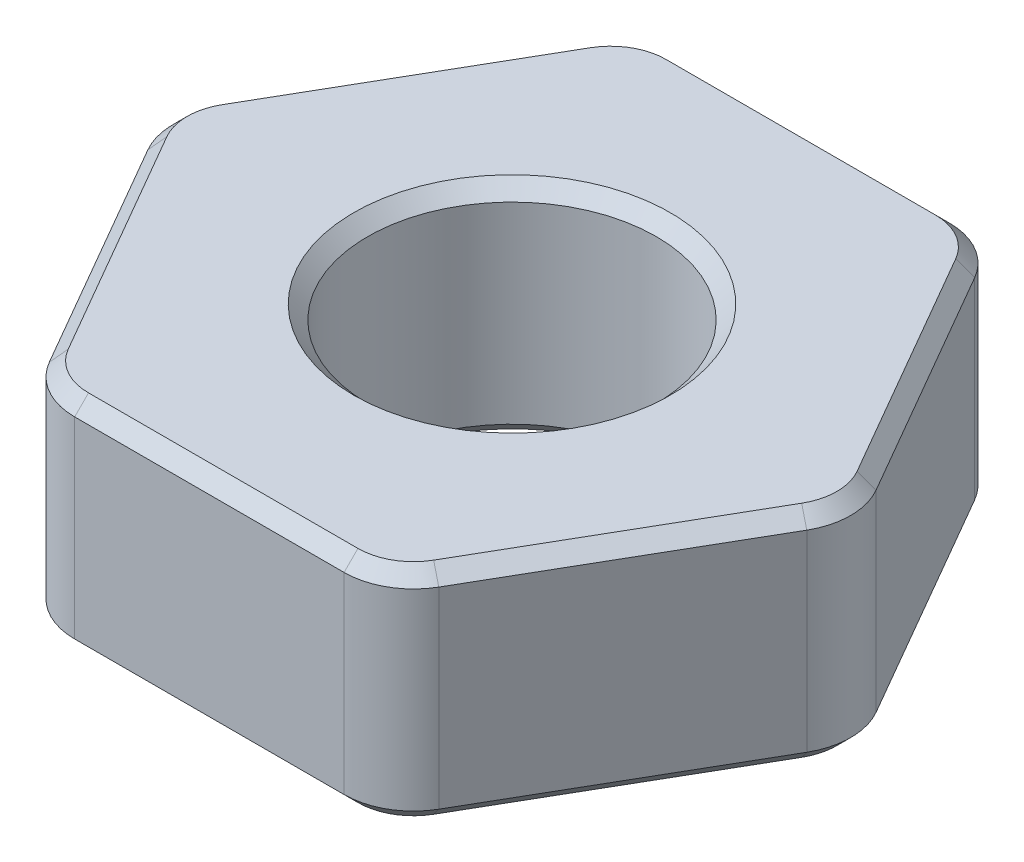
ISO-10303-21;
HEADER;
FILE_DESCRIPTION(('STEP AP214'),'2;1');
FILE_NAME('part.step','',(''),(''),'','','');
FILE_SCHEMA(('AUTOMOTIVE_DESIGN { 1 0 10303 214 1 1 1 1 }'));
ENDSEC;
DATA;
#1=APPLICATION_CONTEXT('core data for automotive mechanical design processes');
#2=APPLICATION_PROTOCOL_DEFINITION('international standard','automotive_design',2000,#1);
#3=PRODUCT_CONTEXT('',#1,'mechanical');
#4=PRODUCT('Part','Part','',(#3));
#5=PRODUCT_RELATED_PRODUCT_CATEGORY('part','',(#4));
#6=PRODUCT_DEFINITION_FORMATION('','',#4);
#7=PRODUCT_DEFINITION_CONTEXT('part definition',#1,'design');
#8=PRODUCT_DEFINITION('design','',#6,#7);
#9=PRODUCT_DEFINITION_SHAPE('','',#8);
#10=(LENGTH_UNIT() NAMED_UNIT(*) SI_UNIT(.MILLI.,.METRE.));
#11=(NAMED_UNIT(*) PLANE_ANGLE_UNIT() SI_UNIT($,.RADIAN.));
#12=(NAMED_UNIT(*) SI_UNIT($,.STERADIAN.) SOLID_ANGLE_UNIT());
#13=UNCERTAINTY_MEASURE_WITH_UNIT(LENGTH_MEASURE(1.E-05),#10,'distance_accuracy_value','');
#14=(GEOMETRIC_REPRESENTATION_CONTEXT(3) GLOBAL_UNCERTAINTY_ASSIGNED_CONTEXT((#13)) GLOBAL_UNIT_ASSIGNED_CONTEXT((#10,
#11,#12)) REPRESENTATION_CONTEXT('',''));
#15=CARTESIAN_POINT('',(0.,0.,0.));
#16=DIRECTION('',(0.,0.,1.));
#17=DIRECTION('',(1.,0.,0.));
#18=AXIS2_PLACEMENT_3D('',#15,#16,#17);
#19=CARTESIAN_POINT('',(0.,1.5875,0.));
#20=DIRECTION('',(0.,1.,0.));
#21=DIRECTION('',(0.,0.,1.));
#22=AXIS2_PLACEMENT_3D('',#19,#20,#21);
#23=PLANE('',#22);
#24=CARTESIAN_POINT('',(0.,1.5875,0.));
#25=DIRECTION('',(0.,1.,0.));
#26=DIRECTION('',(0.,0.,1.));
#27=AXIS2_PLACEMENT_3D('',#24,#25,#26);
#28=CIRCLE('',#27,2.2828);
#29=CARTESIAN_POINT('',(0.,1.5875,2.2828));
#30=VERTEX_POINT('',#29);
#31=EDGE_CURVE('E11',#30,#30,#28,.F.);
#32=ORIENTED_EDGE('',*,*,#31,.T.);
#33=EDGE_LOOP('',(#32));
#34=FACE_BOUND('',#33,.T.);
#35=DIRECTION('',(1.,0.,0.));
#36=VECTOR('',#35,1.);
#37=CARTESIAN_POINT('',(1.94314449974133,1.5875,4.165625));
#38=LINE('',#37,#36);
#39=CARTESIAN_POINT('',(-1.94314449974133,1.5875,4.165625));
#40=VERTEX_POINT('',#39);
#41=CARTESIAN_POINT('',(1.94314449974133,1.5875,4.165625));
#42=VERTEX_POINT('',#41);
#43=EDGE_CURVE('E51',#40,#42,#38,.T.);
#44=ORIENTED_EDGE('',*,*,#43,.T.);
#45=CARTESIAN_POINT('',(1.94314449974133,1.5875,3.365625));
#46=DIRECTION('',(0.,1.,0.));
#47=DIRECTION('',(0.,0.,1.));
#48=AXIS2_PLACEMENT_3D('',#45,#46,#47);
#49=CIRCLE('',#48,0.799999999999999);
#50=CARTESIAN_POINT('',(2.63596482276888,1.5875,3.765625));
#51=VERTEX_POINT('',#50);
#52=EDGE_CURVE('E43',#42,#51,#49,.T.);
#53=ORIENTED_EDGE('',*,*,#52,.T.);
#54=DIRECTION('',(0.5,0.,-0.866025403784439));
#55=VECTOR('',#54,1.);
#56=CARTESIAN_POINT('',(4.57910932251022,1.5875,0.399999999999998));
#57=LINE('',#56,#55);
#58=CARTESIAN_POINT('',(4.57910932251022,1.5875,0.399999999999998));
#59=VERTEX_POINT('',#58);
#60=EDGE_CURVE('E285',#51,#59,#57,.T.);
#61=ORIENTED_EDGE('',*,*,#60,.T.);
#62=CARTESIAN_POINT('',(3.88628899948267,1.5875,0.));
#63=DIRECTION('',(0.,1.,0.));
#64=DIRECTION('',(0.,0.,1.));
#65=AXIS2_PLACEMENT_3D('',#62,#63,#64);
#66=CIRCLE('',#65,0.8);
#67=CARTESIAN_POINT('',(4.57910932251022,1.5875,-0.400000000000002));
#68=VERTEX_POINT('',#67);
#69=EDGE_CURVE('E287',#59,#68,#66,.T.);
#70=ORIENTED_EDGE('',*,*,#69,.T.);
#71=DIRECTION('',(-0.5,0.,-0.866025403784439));
#72=VECTOR('',#71,1.);
#73=CARTESIAN_POINT('',(2.63596482276888,1.5875,-3.765625));
#74=LINE('',#73,#72);
#75=CARTESIAN_POINT('',(2.63596482276888,1.5875,-3.765625));
#76=VERTEX_POINT('',#75);
#77=EDGE_CURVE('E289',#68,#76,#74,.T.);
#78=ORIENTED_EDGE('',*,*,#77,.T.);
#79=CARTESIAN_POINT('',(1.94314449974133,1.5875,-3.365625));
#80=DIRECTION('',(0.,1.,0.));
#81=DIRECTION('',(0.,0.,1.));
#82=AXIS2_PLACEMENT_3D('',#79,#80,#81);
#83=CIRCLE('',#82,0.8);
#84=CARTESIAN_POINT('',(1.94314449974133,1.5875,-4.165625));
#85=VERTEX_POINT('',#84);
#86=EDGE_CURVE('E291',#76,#85,#83,.T.);
#87=ORIENTED_EDGE('',*,*,#86,.T.);
#88=DIRECTION('',(-1.,0.,0.));
#89=VECTOR('',#88,1.);
#90=CARTESIAN_POINT('',(-1.94314449974133,1.5875,-4.165625));
#91=LINE('',#90,#89);
#92=CARTESIAN_POINT('',(-1.94314449974133,1.5875,-4.165625));
#93=VERTEX_POINT('',#92);
#94=EDGE_CURVE('E293',#85,#93,#91,.T.);
#95=ORIENTED_EDGE('',*,*,#94,.T.);
#96=CARTESIAN_POINT('',(-1.94314449974133,1.5875,-3.365625));
#97=DIRECTION('',(0.,1.,0.));
#98=DIRECTION('',(0.,0.,1.));
#99=AXIS2_PLACEMENT_3D('',#96,#97,#98);
#100=CIRCLE('',#99,0.799999999999999);
#101=CARTESIAN_POINT('',(-2.63596482276889,1.5875,-3.765625));
#102=VERTEX_POINT('',#101);
#103=EDGE_CURVE('E295',#93,#102,#100,.T.);
#104=ORIENTED_EDGE('',*,*,#103,.T.);
#105=DIRECTION('',(-0.5,0.,0.866025403784439));
#106=VECTOR('',#105,1.);
#107=CARTESIAN_POINT('',(-4.57910932251022,1.5875,-0.400000000000002));
#108=LINE('',#107,#106);
#109=CARTESIAN_POINT('',(-4.57910932251022,1.5875,-0.400000000000002));
#110=VERTEX_POINT('',#109);
#111=EDGE_CURVE('E297',#102,#110,#108,.T.);
#112=ORIENTED_EDGE('',*,*,#111,.T.);
#113=CARTESIAN_POINT('',(-3.88628899948267,1.5875,0.));
#114=DIRECTION('',(0.,1.,0.));
#115=DIRECTION('',(0.,0.,1.));
#116=AXIS2_PLACEMENT_3D('',#113,#114,#115);
#117=CIRCLE('',#116,0.8);
#118=CARTESIAN_POINT('',(-4.57910932251022,1.5875,0.399999999999998));
#119=VERTEX_POINT('',#118);
#120=EDGE_CURVE('E299',#110,#119,#117,.T.);
#121=ORIENTED_EDGE('',*,*,#120,.T.);
#122=DIRECTION('',(0.5,0.,0.866025403784439));
#123=VECTOR('',#122,1.);
#124=CARTESIAN_POINT('',(-2.63596482276888,1.5875,3.765625));
#125=LINE('',#124,#123);
#126=CARTESIAN_POINT('',(-2.63596482276888,1.5875,3.765625));
#127=VERTEX_POINT('',#126);
#128=EDGE_CURVE('E301',#119,#127,#125,.T.);
#129=ORIENTED_EDGE('',*,*,#128,.T.);
#130=CARTESIAN_POINT('',(-1.94314449974133,1.5875,3.365625));
#131=DIRECTION('',(0.,1.,0.));
#132=DIRECTION('',(0.,0.,1.));
#133=AXIS2_PLACEMENT_3D('',#130,#131,#132);
#134=CIRCLE('',#133,0.799999999999999);
#135=EDGE_CURVE('E56',#127,#40,#134,.T.);
#136=ORIENTED_EDGE('',*,*,#135,.T.);
#137=EDGE_LOOP('',(#44,#53,#61,#70,#78,#87,#95,#104,#112,#121,#129,#136));
#138=FACE_BOUND('',#137,.T.);
#139=ADVANCED_FACE('F34',(#34,#138),#23,.T.);
#140=CARTESIAN_POINT('',(0.,-1.5875,0.));
#141=DIRECTION('',(0.,1.,0.));
#142=DIRECTION('',(0.,0.,1.));
#143=AXIS2_PLACEMENT_3D('',#140,#141,#142);
#144=PLANE('',#143);
#145=CARTESIAN_POINT('',(0.,-1.5875,0.));
#146=DIRECTION('',(0.,1.,0.));
#147=DIRECTION('',(0.,0.,1.));
#148=AXIS2_PLACEMENT_3D('',#145,#146,#147);
#149=CIRCLE('',#148,2.2828);
#150=CARTESIAN_POINT('',(0.,-1.5875,2.2828));
#151=VERTEX_POINT('',#150);
#152=EDGE_CURVE('E223',#151,#151,#149,.T.);
#153=ORIENTED_EDGE('',*,*,#152,.T.);
#154=EDGE_LOOP('',(#153));
#155=FACE_BOUND('',#154,.T.);
#156=DIRECTION('',(1.,0.,0.));
#157=VECTOR('',#156,1.);
#158=CARTESIAN_POINT('',(0.,-1.5875,-4.165625));
#159=LINE('',#158,#157);
#160=CARTESIAN_POINT('',(-1.94314449974133,-1.5875,-4.165625));
#161=VERTEX_POINT('',#160);
#162=CARTESIAN_POINT('',(1.94314449974133,-1.5875,-4.165625));
#163=VERTEX_POINT('',#162);
#164=EDGE_CURVE('E221',#161,#163,#159,.T.);
#165=ORIENTED_EDGE('',*,*,#164,.T.);
#166=CARTESIAN_POINT('',(1.94314449974133,-1.5875,-3.365625));
#167=DIRECTION('',(0.,1.,0.));
#168=DIRECTION('',(0.,0.,1.));
#169=AXIS2_PLACEMENT_3D('',#166,#167,#168);
#170=CIRCLE('',#169,0.800000000000001);
#171=CARTESIAN_POINT('',(2.63596482276889,-1.5875,-3.765625));
#172=VERTEX_POINT('',#171);
#173=EDGE_CURVE('E202',#163,#172,#170,.F.);
#174=ORIENTED_EDGE('',*,*,#173,.T.);
#175=DIRECTION('',(0.5,0.,0.866025403784439));
#176=VECTOR('',#175,1.);
#177=CARTESIAN_POINT('',(3.60753707263955,-1.5875,-2.0828125));
#178=LINE('',#177,#176);
#179=CARTESIAN_POINT('',(4.57910932251022,-1.5875,-0.400000000000002));
#180=VERTEX_POINT('',#179);
#181=EDGE_CURVE('E210',#172,#180,#178,.T.);
#182=ORIENTED_EDGE('',*,*,#181,.T.);
#183=CARTESIAN_POINT('',(3.88628899948267,-1.5875,0.));
#184=DIRECTION('',(0.,1.,0.));
#185=DIRECTION('',(0.,0.,1.));
#186=AXIS2_PLACEMENT_3D('',#183,#184,#185);
#187=CIRCLE('',#186,0.800000000000001);
#188=CARTESIAN_POINT('',(4.57910932251022,-1.5875,0.399999999999998));
#189=VERTEX_POINT('',#188);
#190=EDGE_CURVE('E216',#180,#189,#187,.F.);
#191=ORIENTED_EDGE('',*,*,#190,.T.);
#192=DIRECTION('',(-0.5,0.,0.866025403784439));
#193=VECTOR('',#192,1.);
#194=CARTESIAN_POINT('',(3.60753707263955,-1.5875,2.0828125));
#195=LINE('',#194,#193);
#196=CARTESIAN_POINT('',(2.63596482276889,-1.5875,3.765625));
#197=VERTEX_POINT('',#196);
#198=EDGE_CURVE('E399',#189,#197,#195,.T.);
#199=ORIENTED_EDGE('',*,*,#198,.T.);
#200=CARTESIAN_POINT('',(1.94314449974133,-1.5875,3.365625));
#201=DIRECTION('',(0.,1.,0.));
#202=DIRECTION('',(0.,0.,1.));
#203=AXIS2_PLACEMENT_3D('',#200,#201,#202);
#204=CIRCLE('',#203,0.800000000000001);
#205=CARTESIAN_POINT('',(1.94314449974133,-1.5875,4.165625));
#206=VERTEX_POINT('',#205);
#207=EDGE_CURVE('E401',#197,#206,#204,.F.);
#208=ORIENTED_EDGE('',*,*,#207,.T.);
#209=DIRECTION('',(-1.,0.,0.));
#210=VECTOR('',#209,1.);
#211=CARTESIAN_POINT('',(0.,-1.5875,4.165625));
#212=LINE('',#211,#210);
#213=CARTESIAN_POINT('',(-1.94314449974133,-1.5875,4.165625));
#214=VERTEX_POINT('',#213);
#215=EDGE_CURVE('E403',#206,#214,#212,.T.);
#216=ORIENTED_EDGE('',*,*,#215,.T.);
#217=CARTESIAN_POINT('',(-1.94314449974133,-1.5875,3.365625));
#218=DIRECTION('',(0.,1.,0.));
#219=DIRECTION('',(0.,0.,1.));
#220=AXIS2_PLACEMENT_3D('',#217,#218,#219);
#221=CIRCLE('',#220,0.800000000000001);
#222=CARTESIAN_POINT('',(-2.63596482276888,-1.5875,3.765625));
#223=VERTEX_POINT('',#222);
#224=EDGE_CURVE('E405',#214,#223,#221,.F.);
#225=ORIENTED_EDGE('',*,*,#224,.T.);
#226=DIRECTION('',(-0.5,0.,-0.866025403784439));
#227=VECTOR('',#226,1.);
#228=CARTESIAN_POINT('',(-3.60753707263955,-1.5875,2.0828125));
#229=LINE('',#228,#227);
#230=CARTESIAN_POINT('',(-4.57910932251022,-1.5875,0.399999999999999));
#231=VERTEX_POINT('',#230);
#232=EDGE_CURVE('E407',#223,#231,#229,.T.);
#233=ORIENTED_EDGE('',*,*,#232,.T.);
#234=CARTESIAN_POINT('',(-3.88628899948267,-1.5875,0.));
#235=DIRECTION('',(0.,1.,0.));
#236=DIRECTION('',(0.,0.,1.));
#237=AXIS2_PLACEMENT_3D('',#234,#235,#236);
#238=CIRCLE('',#237,0.800000000000001);
#239=CARTESIAN_POINT('',(-4.57910932251022,-1.5875,-0.400000000000002));
#240=VERTEX_POINT('',#239);
#241=EDGE_CURVE('E409',#231,#240,#238,.F.);
#242=ORIENTED_EDGE('',*,*,#241,.T.);
#243=DIRECTION('',(0.5,0.,-0.866025403784439));
#244=VECTOR('',#243,1.);
#245=CARTESIAN_POINT('',(-3.60753707263955,-1.5875,-2.0828125));
#246=LINE('',#245,#244);
#247=CARTESIAN_POINT('',(-2.63596482276889,-1.5875,-3.765625));
#248=VERTEX_POINT('',#247);
#249=EDGE_CURVE('E411',#240,#248,#246,.T.);
#250=ORIENTED_EDGE('',*,*,#249,.T.);
#251=CARTESIAN_POINT('',(-1.94314449974133,-1.5875,-3.365625));
#252=DIRECTION('',(0.,1.,0.));
#253=DIRECTION('',(0.,0.,1.));
#254=AXIS2_PLACEMENT_3D('',#251,#252,#253);
#255=CIRCLE('',#254,0.800000000000001);
#256=EDGE_CURVE('E228',#248,#161,#255,.F.);
#257=ORIENTED_EDGE('',*,*,#256,.T.);
#258=EDGE_LOOP('',(#165,#174,#182,#191,#199,#208,#216,#225,#233,#242,#250,#257));
#259=FACE_BOUND('',#258,.T.);
#260=ADVANCED_FACE('F219',(#155,#259),#144,.F.);
#261=CARTESIAN_POINT('',(5.04098953786192,1.5875,0.));
#262=DIRECTION('',(-0.866025403784438,0.,0.5));
#263=DIRECTION('',(0.5,0.,0.866025403784439));
#264=AXIS2_PLACEMENT_3D('',#261,#262,#263);
#265=PLANE('',#264);
#266=DIRECTION('',(0.,-1.,0.));
#267=VECTOR('',#266,1.);
#268=CARTESIAN_POINT('',(4.75231440326711,1.5875,-0.500000000000002));
#269=LINE('',#268,#267);
#270=CARTESIAN_POINT('',(4.75231440326711,1.3875,-0.500000000000002));
#271=VERTEX_POINT('',#270);
#272=CARTESIAN_POINT('',(4.75231440326711,-1.3875,-0.500000000000002));
#273=VERTEX_POINT('',#272);
#274=EDGE_CURVE('E428',#271,#273,#269,.T.);
#275=ORIENTED_EDGE('',*,*,#274,.T.);
#276=DIRECTION('',(-0.5,0.,-0.866025403784439));
#277=VECTOR('',#276,1.);
#278=CARTESIAN_POINT('',(5.04098953786192,-1.3875,0.));
#279=LINE('',#278,#277);
#280=CARTESIAN_POINT('',(2.80916990352577,-1.3875,-3.865625));
#281=VERTEX_POINT('',#280);
#282=EDGE_CURVE('E283',#273,#281,#279,.T.);
#283=ORIENTED_EDGE('',*,*,#282,.T.);
#284=DIRECTION('',(0.,-1.,0.));
#285=VECTOR('',#284,1.);
#286=CARTESIAN_POINT('',(2.80916990352577,1.5875,-3.865625));
#287=LINE('',#286,#285);
#288=CARTESIAN_POINT('',(2.80916990352577,1.3875,-3.865625));
#289=VERTEX_POINT('',#288);
#290=EDGE_CURVE('E335',#281,#289,#287,.F.);
#291=ORIENTED_EDGE('',*,*,#290,.T.);
#292=DIRECTION('',(0.5,0.,0.866025403784439));
#293=VECTOR('',#292,1.);
#294=CARTESIAN_POINT('',(4.75231440326711,1.3875,-0.500000000000001));
#295=LINE('',#294,#293);
#296=EDGE_CURVE('E281',#289,#271,#295,.T.);
#297=ORIENTED_EDGE('',*,*,#296,.T.);
#298=EDGE_LOOP('',(#275,#283,#291,#297));
#299=FACE_BOUND('',#298,.T.);
#300=ADVANCED_FACE('F486',(#299),#265,.F.);
#301=CARTESIAN_POINT('',(2.52049476893096,1.5875,-4.365625));
#302=DIRECTION('',(0.,0.,1.));
#303=DIRECTION('',(1.,0.,0.));
#304=AXIS2_PLACEMENT_3D('',#301,#302,#303);
#305=PLANE('',#304);
#306=DIRECTION('',(0.,-1.,0.));
#307=VECTOR('',#306,1.);
#308=CARTESIAN_POINT('',(1.94314449974133,1.5875,-4.365625));
#309=LINE('',#308,#307);
#310=CARTESIAN_POINT('',(1.94314449974133,1.3875,-4.365625));
#311=VERTEX_POINT('',#310);
#312=CARTESIAN_POINT('',(1.94314449974133,-1.3875,-4.365625));
#313=VERTEX_POINT('',#312);
#314=EDGE_CURVE('E392',#311,#313,#309,.T.);
#315=ORIENTED_EDGE('',*,*,#314,.T.);
#316=DIRECTION('',(-1.,0.,0.));
#317=VECTOR('',#316,1.);
#318=CARTESIAN_POINT('',(2.52049476893096,-1.3875,-4.365625));
#319=LINE('',#318,#317);
#320=CARTESIAN_POINT('',(-1.94314449974133,-1.3875,-4.365625));
#321=VERTEX_POINT('',#320);
#322=EDGE_CURVE('E242',#313,#321,#319,.T.);
#323=ORIENTED_EDGE('',*,*,#322,.T.);
#324=DIRECTION('',(0.,-1.,0.));
#325=VECTOR('',#324,1.);
#326=CARTESIAN_POINT('',(-1.94314449974133,1.5875,-4.365625));
#327=LINE('',#326,#325);
#328=CARTESIAN_POINT('',(-1.94314449974133,1.3875,-4.365625));
#329=VERTEX_POINT('',#328);
#330=EDGE_CURVE('E217',#321,#329,#327,.F.);
#331=ORIENTED_EDGE('',*,*,#330,.T.);
#332=DIRECTION('',(1.,0.,0.));
#333=VECTOR('',#332,1.);
#334=CARTESIAN_POINT('',(1.94314449974133,1.3875,-4.365625));
#335=LINE('',#334,#333);
#336=EDGE_CURVE('E240',#329,#311,#335,.T.);
#337=ORIENTED_EDGE('',*,*,#336,.T.);
#338=EDGE_LOOP('',(#315,#323,#331,#337));
#339=FACE_BOUND('',#338,.T.);
#340=ADVANCED_FACE('F389',(#339),#305,.F.);
#341=CARTESIAN_POINT('',(-2.52049476893096,1.5875,-4.365625));
#342=DIRECTION('',(0.866025403784439,0.,0.5));
#343=DIRECTION('',(0.5,0.,-0.866025403784439));
#344=AXIS2_PLACEMENT_3D('',#341,#342,#343);
#345=PLANE('',#344);
#346=DIRECTION('',(0.,-1.,0.));
#347=VECTOR('',#346,1.);
#348=CARTESIAN_POINT('',(-2.80916990352577,1.5875,-3.865625));
#349=LINE('',#348,#347);
#350=CARTESIAN_POINT('',(-2.80916990352577,1.3875,-3.865625));
#351=VERTEX_POINT('',#350);
#352=CARTESIAN_POINT('',(-2.80916990352577,-1.3875,-3.865625));
#353=VERTEX_POINT('',#352);
#354=EDGE_CURVE('E386',#351,#353,#349,.T.);
#355=ORIENTED_EDGE('',*,*,#354,.T.);
#356=DIRECTION('',(-0.5,0.,0.866025403784439));
#357=VECTOR('',#356,1.);
#358=CARTESIAN_POINT('',(-2.52049476893096,-1.3875,-4.365625));
#359=LINE('',#358,#357);
#360=CARTESIAN_POINT('',(-4.75231440326711,-1.3875,-0.500000000000002));
#361=VERTEX_POINT('',#360);
#362=EDGE_CURVE('E250',#353,#361,#359,.T.);
#363=ORIENTED_EDGE('',*,*,#362,.T.);
#364=DIRECTION('',(0.,-1.,0.));
#365=VECTOR('',#364,1.);
#366=CARTESIAN_POINT('',(-4.75231440326711,1.5875,-0.500000000000002));
#367=LINE('',#366,#365);
#368=CARTESIAN_POINT('',(-4.75231440326711,1.3875,-0.500000000000002));
#369=VERTEX_POINT('',#368);
#370=EDGE_CURVE('E394',#361,#369,#367,.F.);
#371=ORIENTED_EDGE('',*,*,#370,.T.);
#372=DIRECTION('',(0.5,0.,-0.866025403784439));
#373=VECTOR('',#372,1.);
#374=CARTESIAN_POINT('',(-2.80916990352577,1.3875,-3.865625));
#375=LINE('',#374,#373);
#376=EDGE_CURVE('E248',#369,#351,#375,.T.);
#377=ORIENTED_EDGE('',*,*,#376,.T.);
#378=EDGE_LOOP('',(#355,#363,#371,#377));
#379=FACE_BOUND('',#378,.T.);
#380=ADVANCED_FACE('F454',(#379),#345,.F.);
#381=CARTESIAN_POINT('',(-5.04098953786192,1.5875,0.));
#382=DIRECTION('',(0.866025403784439,0.,-0.5));
#383=DIRECTION('',(-0.5,0.,-0.866025403784439));
#384=AXIS2_PLACEMENT_3D('',#381,#382,#383);
#385=PLANE('',#384);
#386=DIRECTION('',(0.,-1.,0.));
#387=VECTOR('',#386,1.);
#388=CARTESIAN_POINT('',(-4.75231440326711,1.5875,0.499999999999998));
#389=LINE('',#388,#387);
#390=CARTESIAN_POINT('',(-4.75231440326711,1.3875,0.499999999999998));
#391=VERTEX_POINT('',#390);
#392=CARTESIAN_POINT('',(-4.75231440326711,-1.3875,0.499999999999998));
#393=VERTEX_POINT('',#392);
#394=EDGE_CURVE('E448',#391,#393,#389,.T.);
#395=ORIENTED_EDGE('',*,*,#394,.T.);
#396=DIRECTION('',(0.5,0.,0.866025403784439));
#397=VECTOR('',#396,1.);
#398=CARTESIAN_POINT('',(-5.04098953786192,-1.3875,0.));
#399=LINE('',#398,#397);
#400=CARTESIAN_POINT('',(-2.80916990352577,-1.3875,3.865625));
#401=VERTEX_POINT('',#400);
#402=EDGE_CURVE('E258',#393,#401,#399,.T.);
#403=ORIENTED_EDGE('',*,*,#402,.T.);
#404=DIRECTION('',(0.,-1.,0.));
#405=VECTOR('',#404,1.);
#406=CARTESIAN_POINT('',(-2.80916990352577,1.5875,3.865625));
#407=LINE('',#406,#405);
#408=CARTESIAN_POINT('',(-2.80916990352577,1.3875,3.865625));
#409=VERTEX_POINT('',#408);
#410=EDGE_CURVE('E445',#401,#409,#407,.F.);
#411=ORIENTED_EDGE('',*,*,#410,.T.);
#412=DIRECTION('',(-0.5,0.,-0.866025403784439));
#413=VECTOR('',#412,1.);
#414=CARTESIAN_POINT('',(-4.75231440326711,1.3875,0.499999999999998));
#415=LINE('',#414,#413);
#416=EDGE_CURVE('E256',#409,#391,#415,.T.);
#417=ORIENTED_EDGE('',*,*,#416,.T.);
#418=EDGE_LOOP('',(#395,#403,#411,#417));
#419=FACE_BOUND('',#418,.T.);
#420=ADVANCED_FACE('F499',(#419),#385,.F.);
#421=CARTESIAN_POINT('',(-2.52049476893096,1.5875,4.365625));
#422=DIRECTION('',(0.,0.,-1.));
#423=DIRECTION('',(-1.,0.,0.));
#424=AXIS2_PLACEMENT_3D('',#421,#422,#423);
#425=PLANE('',#424);
#426=DIRECTION('',(0.,-1.,0.));
#427=VECTOR('',#426,1.);
#428=CARTESIAN_POINT('',(-1.94314449974133,1.5875,4.365625));
#429=LINE('',#428,#427);
#430=CARTESIAN_POINT('',(-1.94314449974133,1.3875,4.365625));
#431=VERTEX_POINT('',#430);
#432=CARTESIAN_POINT('',(-1.94314449974133,-1.3875,4.365625));
#433=VERTEX_POINT('',#432);
#434=EDGE_CURVE('E439',#431,#433,#429,.T.);
#435=ORIENTED_EDGE('',*,*,#434,.T.);
#436=DIRECTION('',(1.,0.,0.));
#437=VECTOR('',#436,1.);
#438=CARTESIAN_POINT('',(-2.52049476893096,-1.3875,4.365625));
#439=LINE('',#438,#437);
#440=CARTESIAN_POINT('',(1.94314449974133,-1.3875,4.365625));
#441=VERTEX_POINT('',#440);
#442=EDGE_CURVE('E266',#433,#441,#439,.T.);
#443=ORIENTED_EDGE('',*,*,#442,.T.);
#444=DIRECTION('',(0.,-1.,0.));
#445=VECTOR('',#444,1.);
#446=CARTESIAN_POINT('',(1.94314449974133,1.5875,4.365625));
#447=LINE('',#446,#445);
#448=CARTESIAN_POINT('',(1.94314449974133,1.3875,4.365625));
#449=VERTEX_POINT('',#448);
#450=EDGE_CURVE('E442',#441,#449,#447,.F.);
#451=ORIENTED_EDGE('',*,*,#450,.T.);
#452=DIRECTION('',(-1.,0.,0.));
#453=VECTOR('',#452,1.);
#454=CARTESIAN_POINT('',(-1.94314449974133,1.3875,4.365625));
#455=LINE('',#454,#453);
#456=EDGE_CURVE('E264',#449,#431,#455,.T.);
#457=ORIENTED_EDGE('',*,*,#456,.T.);
#458=EDGE_LOOP('',(#435,#443,#451,#457));
#459=FACE_BOUND('',#458,.T.);
#460=ADVANCED_FACE('F495',(#459),#425,.F.);
#461=CARTESIAN_POINT('',(2.52049476893096,1.5875,4.365625));
#462=DIRECTION('',(-0.866025403784439,0.,-0.5));
#463=DIRECTION('',(-0.5,0.,0.866025403784439));
#464=AXIS2_PLACEMENT_3D('',#461,#462,#463);
#465=PLANE('',#464);
#466=DIRECTION('',(0.,-1.,0.));
#467=VECTOR('',#466,1.);
#468=CARTESIAN_POINT('',(2.80916990352577,1.5875,3.865625));
#469=LINE('',#468,#467);
#470=CARTESIAN_POINT('',(2.80916990352577,1.3875,3.865625));
#471=VERTEX_POINT('',#470);
#472=CARTESIAN_POINT('',(2.80916990352577,-1.3875,3.865625));
#473=VERTEX_POINT('',#472);
#474=EDGE_CURVE('E431',#471,#473,#469,.T.);
#475=ORIENTED_EDGE('',*,*,#474,.T.);
#476=DIRECTION('',(0.5,0.,-0.866025403784439));
#477=VECTOR('',#476,1.);
#478=CARTESIAN_POINT('',(2.52049476893096,-1.3875,4.365625));
#479=LINE('',#478,#477);
#480=CARTESIAN_POINT('',(4.75231440326711,-1.3875,0.499999999999998));
#481=VERTEX_POINT('',#480);
#482=EDGE_CURVE('E275',#473,#481,#479,.T.);
#483=ORIENTED_EDGE('',*,*,#482,.T.);
#484=DIRECTION('',(0.,-1.,0.));
#485=VECTOR('',#484,1.);
#486=CARTESIAN_POINT('',(4.75231440326711,1.5875,0.499999999999998));
#487=LINE('',#486,#485);
#488=CARTESIAN_POINT('',(4.75231440326711,1.3875,0.499999999999998));
#489=VERTEX_POINT('',#488);
#490=EDGE_CURVE('E436',#481,#489,#487,.F.);
#491=ORIENTED_EDGE('',*,*,#490,.T.);
#492=DIRECTION('',(-0.5,0.,0.866025403784439));
#493=VECTOR('',#492,1.);
#494=CARTESIAN_POINT('',(2.80916990352577,1.3875,3.865625));
#495=LINE('',#494,#493);
#496=EDGE_CURVE('E273',#489,#471,#495,.T.);
#497=ORIENTED_EDGE('',*,*,#496,.T.);
#498=EDGE_LOOP('',(#475,#483,#491,#497));
#499=FACE_BOUND('',#498,.T.);
#500=ADVANCED_FACE('F492',(#499),#465,.F.);
#501=CARTESIAN_POINT('',(0.,1.5875,0.));
#502=DIRECTION('',(0.,-1.,0.));
#503=DIRECTION('',(0.,0.,-1.));
#504=AXIS2_PLACEMENT_3D('',#501,#502,#503);
#505=CYLINDRICAL_SURFACE('',#504,2.0828);
#506=CARTESIAN_POINT('',(0.,-1.3875,0.));
#507=DIRECTION('',(0.,1.,0.));
#508=DIRECTION('',(0.,0.,1.));
#509=AXIS2_PLACEMENT_3D('',#506,#507,#508);
#510=CIRCLE('',#509,2.0828);
#511=CARTESIAN_POINT('',(0.,-1.3875,2.0828));
#512=VERTEX_POINT('',#511);
#513=EDGE_CURVE('E234',#512,#512,#510,.F.);
#514=ORIENTED_EDGE('',*,*,#513,.T.);
#515=EDGE_LOOP('',(#514));
#516=FACE_BOUND('',#515,.T.);
#517=CARTESIAN_POINT('',(0.,1.3875,0.));
#518=DIRECTION('',(0.,1.,0.));
#519=DIRECTION('',(0.,0.,1.));
#520=AXIS2_PLACEMENT_3D('',#517,#518,#519);
#521=CIRCLE('',#520,2.0828);
#522=CARTESIAN_POINT('',(0.,1.3875,2.0828));
#523=VERTEX_POINT('',#522);
#524=EDGE_CURVE('E226',#523,#523,#521,.T.);
#525=ORIENTED_EDGE('',*,*,#524,.T.);
#526=EDGE_LOOP('',(#525));
#527=FACE_BOUND('',#526,.T.);
#528=ADVANCED_FACE('F490',(#516,#527),#505,.F.);
#529=CARTESIAN_POINT('',(3.88628899948267,1.5875,0.));
#530=DIRECTION('',(0.,-1.,0.));
#531=DIRECTION('',(0.,0.,-1.));
#532=AXIS2_PLACEMENT_3D('',#529,#530,#531);
#533=CYLINDRICAL_SURFACE('',#532,1.);
#534=ORIENTED_EDGE('',*,*,#490,.F.);
#535=CARTESIAN_POINT('',(3.88628899948267,-1.3875,0.));
#536=DIRECTION('',(0.,1.,0.));
#537=DIRECTION('',(0.,0.,1.));
#538=AXIS2_PLACEMENT_3D('',#535,#536,#537);
#539=CIRCLE('',#538,1.);
#540=EDGE_CURVE('E279',#481,#273,#539,.T.);
#541=ORIENTED_EDGE('',*,*,#540,.T.);
#542=ORIENTED_EDGE('',*,*,#274,.F.);
#543=CARTESIAN_POINT('',(3.88628899948267,1.3875,0.));
#544=DIRECTION('',(0.,1.,0.));
#545=DIRECTION('',(0.,0.,1.));
#546=AXIS2_PLACEMENT_3D('',#543,#544,#545);
#547=CIRCLE('',#546,1.);
#548=EDGE_CURVE('E277',#271,#489,#547,.F.);
#549=ORIENTED_EDGE('',*,*,#548,.T.);
#550=EDGE_LOOP('',(#534,#541,#542,#549));
#551=FACE_BOUND('',#550,.T.);
#552=ADVANCED_FACE('F510',(#551),#533,.T.);
#553=CARTESIAN_POINT('',(1.94314449974133,1.5875,3.365625));
#554=DIRECTION('',(0.,-1.,0.));
#555=DIRECTION('',(0.,0.,-1.));
#556=AXIS2_PLACEMENT_3D('',#553,#554,#555);
#557=CYLINDRICAL_SURFACE('',#556,1.);
#558=ORIENTED_EDGE('',*,*,#450,.F.);
#559=CARTESIAN_POINT('',(1.94314449974133,-1.3875,3.365625));
#560=DIRECTION('',(0.,1.,0.));
#561=DIRECTION('',(0.,0.,1.));
#562=AXIS2_PLACEMENT_3D('',#559,#560,#561);
#563=CIRCLE('',#562,1.);
#564=EDGE_CURVE('E271',#441,#473,#563,.T.);
#565=ORIENTED_EDGE('',*,*,#564,.T.);
#566=ORIENTED_EDGE('',*,*,#474,.F.);
#567=CARTESIAN_POINT('',(1.94314449974133,1.3875,3.365625));
#568=DIRECTION('',(0.,1.,0.));
#569=DIRECTION('',(0.,0.,1.));
#570=AXIS2_PLACEMENT_3D('',#567,#568,#569);
#571=CIRCLE('',#570,1.);
#572=EDGE_CURVE('E268',#471,#449,#571,.F.);
#573=ORIENTED_EDGE('',*,*,#572,.T.);
#574=EDGE_LOOP('',(#558,#565,#566,#573));
#575=FACE_BOUND('',#574,.T.);
#576=ADVANCED_FACE('F513',(#575),#557,.T.);
#577=CARTESIAN_POINT('',(-3.88628899948267,1.5875,0.));
#578=DIRECTION('',(0.,-1.,0.));
#579=DIRECTION('',(0.,0.,-1.));
#580=AXIS2_PLACEMENT_3D('',#577,#578,#579);
#581=CYLINDRICAL_SURFACE('',#580,1.);
#582=ORIENTED_EDGE('',*,*,#370,.F.);
#583=CARTESIAN_POINT('',(-3.88628899948267,-1.3875,0.));
#584=DIRECTION('',(0.,1.,0.));
#585=DIRECTION('',(0.,0.,1.));
#586=AXIS2_PLACEMENT_3D('',#583,#584,#585);
#587=CIRCLE('',#586,1.);
#588=EDGE_CURVE('E254',#361,#393,#587,.T.);
#589=ORIENTED_EDGE('',*,*,#588,.T.);
#590=ORIENTED_EDGE('',*,*,#394,.F.);
#591=CARTESIAN_POINT('',(-3.88628899948267,1.3875,0.));
#592=DIRECTION('',(0.,1.,0.));
#593=DIRECTION('',(0.,0.,1.));
#594=AXIS2_PLACEMENT_3D('',#591,#592,#593);
#595=CIRCLE('',#594,1.);
#596=EDGE_CURVE('E252',#391,#369,#595,.F.);
#597=ORIENTED_EDGE('',*,*,#596,.T.);
#598=EDGE_LOOP('',(#582,#589,#590,#597));
#599=FACE_BOUND('',#598,.T.);
#600=ADVANCED_FACE('F458',(#599),#581,.T.);
#601=CARTESIAN_POINT('',(-1.94314449974133,1.5875,-3.365625));
#602=DIRECTION('',(0.,-1.,0.));
#603=DIRECTION('',(0.,0.,-1.));
#604=AXIS2_PLACEMENT_3D('',#601,#602,#603);
#605=CYLINDRICAL_SURFACE('',#604,1.);
#606=ORIENTED_EDGE('',*,*,#330,.F.);
#607=CARTESIAN_POINT('',(-1.94314449974133,-1.3875,-3.365625));
#608=DIRECTION('',(0.,1.,0.));
#609=DIRECTION('',(0.,0.,1.));
#610=AXIS2_PLACEMENT_3D('',#607,#608,#609);
#611=CIRCLE('',#610,1.);
#612=EDGE_CURVE('E246',#321,#353,#611,.T.);
#613=ORIENTED_EDGE('',*,*,#612,.T.);
#614=ORIENTED_EDGE('',*,*,#354,.F.);
#615=CARTESIAN_POINT('',(-1.94314449974133,1.3875,-3.365625));
#616=DIRECTION('',(0.,1.,0.));
#617=DIRECTION('',(0.,0.,1.));
#618=AXIS2_PLACEMENT_3D('',#615,#616,#617);
#619=CIRCLE('',#618,1.);
#620=EDGE_CURVE('E244',#351,#329,#619,.F.);
#621=ORIENTED_EDGE('',*,*,#620,.T.);
#622=EDGE_LOOP('',(#606,#613,#614,#621));
#623=FACE_BOUND('',#622,.T.);
#624=ADVANCED_FACE('F383',(#623),#605,.T.);
#625=CARTESIAN_POINT('',(1.94314449974133,1.5875,-3.365625));
#626=DIRECTION('',(0.,-1.,0.));
#627=DIRECTION('',(0.,0.,-1.));
#628=AXIS2_PLACEMENT_3D('',#625,#626,#627);
#629=CYLINDRICAL_SURFACE('',#628,1.);
#630=ORIENTED_EDGE('',*,*,#290,.F.);
#631=CARTESIAN_POINT('',(1.94314449974133,-1.3875,-3.365625));
#632=DIRECTION('',(0.,1.,0.));
#633=DIRECTION('',(0.,0.,1.));
#634=AXIS2_PLACEMENT_3D('',#631,#632,#633);
#635=CIRCLE('',#634,1.);
#636=EDGE_CURVE('E204',#281,#313,#635,.T.);
#637=ORIENTED_EDGE('',*,*,#636,.T.);
#638=ORIENTED_EDGE('',*,*,#314,.F.);
#639=CARTESIAN_POINT('',(1.94314449974133,1.3875,-3.365625));
#640=DIRECTION('',(0.,1.,0.));
#641=DIRECTION('',(0.,0.,1.));
#642=AXIS2_PLACEMENT_3D('',#639,#640,#641);
#643=CIRCLE('',#642,1.);
#644=EDGE_CURVE('E237',#311,#289,#643,.F.);
#645=ORIENTED_EDGE('',*,*,#644,.T.);
#646=EDGE_LOOP('',(#630,#637,#638,#645));
#647=FACE_BOUND('',#646,.T.);
#648=ADVANCED_FACE('F422',(#647),#629,.T.);
#649=CARTESIAN_POINT('',(-1.94314449974133,1.5875,3.365625));
#650=DIRECTION('',(0.,-1.,0.));
#651=DIRECTION('',(0.,0.,-1.));
#652=AXIS2_PLACEMENT_3D('',#649,#650,#651);
#653=CYLINDRICAL_SURFACE('',#652,1.);
#654=ORIENTED_EDGE('',*,*,#410,.F.);
#655=CARTESIAN_POINT('',(-1.94314449974133,-1.3875,3.365625));
#656=DIRECTION('',(0.,1.,0.));
#657=DIRECTION('',(0.,0.,1.));
#658=AXIS2_PLACEMENT_3D('',#655,#656,#657);
#659=CIRCLE('',#658,1.);
#660=EDGE_CURVE('E262',#401,#433,#659,.T.);
#661=ORIENTED_EDGE('',*,*,#660,.T.);
#662=ORIENTED_EDGE('',*,*,#434,.F.);
#663=CARTESIAN_POINT('',(-1.94314449974133,1.3875,3.365625));
#664=DIRECTION('',(0.,1.,0.));
#665=DIRECTION('',(0.,0.,1.));
#666=AXIS2_PLACEMENT_3D('',#663,#664,#665);
#667=CIRCLE('',#666,1.);
#668=EDGE_CURVE('E260',#431,#409,#667,.F.);
#669=ORIENTED_EDGE('',*,*,#668,.T.);
#670=EDGE_LOOP('',(#654,#661,#662,#669));
#671=FACE_BOUND('',#670,.T.);
#672=ADVANCED_FACE('F524',(#671),#653,.T.);
#673=CARTESIAN_POINT('',(0.,-1.5875,0.));
#674=DIRECTION('',(0.,-1.,0.));
#675=DIRECTION('',(0.,0.,-1.));
#676=AXIS2_PLACEMENT_3D('',#673,#674,#675);
#677=CONICAL_SURFACE('',#676,2.2828,0.785398163397444);
#678=ORIENTED_EDGE('',*,*,#513,.F.);
#679=EDGE_LOOP('',(#678));
#680=FACE_BOUND('',#679,.T.);
#681=ORIENTED_EDGE('',*,*,#152,.F.);
#682=EDGE_LOOP('',(#681));
#683=FACE_BOUND('',#682,.T.);
#684=ADVANCED_FACE('F527',(#680,#683),#677,.F.);
#685=CARTESIAN_POINT('',(-1.94314449974133,-1.5875,3.365625));
#686=DIRECTION('',(0.,1.,0.));
#687=DIRECTION('',(0.,0.,1.));
#688=AXIS2_PLACEMENT_3D('',#685,#686,#687);
#689=CONICAL_SURFACE('',#688,0.800000000000001,0.785398163397448);
#690=DIRECTION('',(0.,-0.707106781186548,-0.707106781186548));
#691=VECTOR('',#690,1.);
#692=CARTESIAN_POINT('',(-1.94314449974133,-1.3875,4.365625));
#693=LINE('',#692,#691);
#694=EDGE_CURVE('E329',#433,#214,#693,.T.);
#695=ORIENTED_EDGE('',*,*,#694,.F.);
#696=ORIENTED_EDGE('',*,*,#660,.F.);
#697=DIRECTION('',(-0.612372435695795,0.707106781186547,0.353553390593275));
#698=VECTOR('',#697,1.);
#699=CARTESIAN_POINT('',(-2.63596482276888,-1.5875,3.765625));
#700=LINE('',#699,#698);
#701=EDGE_CURVE('E332',#223,#401,#700,.T.);
#702=ORIENTED_EDGE('',*,*,#701,.F.);
#703=ORIENTED_EDGE('',*,*,#224,.F.);
#704=EDGE_LOOP('',(#695,#696,#702,#703));
#705=FACE_BOUND('',#704,.T.);
#706=ADVANCED_FACE('F531',(#705),#689,.T.);
#707=CARTESIAN_POINT('',(-5.04098953786192,-1.3875,0.));
#708=DIRECTION('',(0.612372435695796,0.707106781186546,-0.353553390593274));
#709=DIRECTION('',(0.5,0.,0.866025403784439));
#710=AXIS2_PLACEMENT_3D('',#707,#708,#709);
#711=PLANE('',#710);
#712=ORIENTED_EDGE('',*,*,#701,.T.);
#713=ORIENTED_EDGE('',*,*,#402,.F.);
#714=DIRECTION('',(-0.612372435695792,0.707106781186549,0.353553390593274));
#715=VECTOR('',#714,1.);
#716=CARTESIAN_POINT('',(-4.57910932251022,-1.5875,0.399999999999999));
#717=LINE('',#716,#715);
#718=EDGE_CURVE('E326',#231,#393,#717,.T.);
#719=ORIENTED_EDGE('',*,*,#718,.F.);
#720=ORIENTED_EDGE('',*,*,#232,.F.);
#721=EDGE_LOOP('',(#712,#713,#719,#720));
#722=FACE_BOUND('',#721,.T.);
#723=ADVANCED_FACE('F726',(#722),#711,.F.);
#724=CARTESIAN_POINT('',(-2.52049476893096,-1.3875,4.365625));
#725=DIRECTION('',(0.,0.707106781186548,-0.707106781186548));
#726=DIRECTION('',(1.,0.,0.));
#727=AXIS2_PLACEMENT_3D('',#724,#725,#726);
#728=PLANE('',#727);
#729=ORIENTED_EDGE('',*,*,#694,.T.);
#730=ORIENTED_EDGE('',*,*,#215,.F.);
#731=DIRECTION('',(0.,-0.707106781186548,-0.707106781186548));
#732=VECTOR('',#731,1.);
#733=CARTESIAN_POINT('',(1.94314449974133,-1.3875,4.365625));
#734=LINE('',#733,#732);
#735=EDGE_CURVE('E323',#441,#206,#734,.T.);
#736=ORIENTED_EDGE('',*,*,#735,.F.);
#737=ORIENTED_EDGE('',*,*,#442,.F.);
#738=EDGE_LOOP('',(#729,#730,#736,#737));
#739=FACE_BOUND('',#738,.T.);
#740=ADVANCED_FACE('F718',(#739),#728,.F.);
#741=CARTESIAN_POINT('',(-3.88628899948267,-1.5875,0.));
#742=DIRECTION('',(0.,1.,0.));
#743=DIRECTION('',(0.,0.,1.));
#744=AXIS2_PLACEMENT_3D('',#741,#742,#743);
#745=CONICAL_SURFACE('',#744,0.800000000000001,0.785398163397449);
#746=ORIENTED_EDGE('',*,*,#718,.T.);
#747=ORIENTED_EDGE('',*,*,#588,.F.);
#748=DIRECTION('',(-0.612372435695796,0.707106781186546,-0.353553390593273));
#749=VECTOR('',#748,1.);
#750=CARTESIAN_POINT('',(-4.57910932251022,-1.5875,-0.400000000000002));
#751=LINE('',#750,#749);
#752=EDGE_CURVE('E320',#240,#361,#751,.T.);
#753=ORIENTED_EDGE('',*,*,#752,.F.);
#754=ORIENTED_EDGE('',*,*,#241,.F.);
#755=EDGE_LOOP('',(#746,#747,#753,#754));
#756=FACE_BOUND('',#755,.T.);
#757=ADVANCED_FACE('F463',(#756),#745,.T.);
#758=CARTESIAN_POINT('',(1.94314449974133,-1.5875,3.365625));
#759=DIRECTION('',(0.,1.,0.));
#760=DIRECTION('',(0.,0.,1.));
#761=AXIS2_PLACEMENT_3D('',#758,#759,#760);
#762=CONICAL_SURFACE('',#761,0.800000000000001,0.785398163397448);
#763=ORIENTED_EDGE('',*,*,#735,.T.);
#764=ORIENTED_EDGE('',*,*,#207,.F.);
#765=DIRECTION('',(-0.612372435695794,-0.707106781186548,-0.353553390593274));
#766=VECTOR('',#765,1.);
#767=CARTESIAN_POINT('',(2.80916990352577,-1.3875,3.865625));
#768=LINE('',#767,#766);
#769=EDGE_CURVE('E317',#473,#197,#768,.T.);
#770=ORIENTED_EDGE('',*,*,#769,.F.);
#771=ORIENTED_EDGE('',*,*,#564,.F.);
#772=EDGE_LOOP('',(#763,#764,#770,#771));
#773=FACE_BOUND('',#772,.T.);
#774=ADVANCED_FACE('F470',(#773),#762,.T.);
#775=CARTESIAN_POINT('',(-2.52049476893096,-1.3875,-4.365625));
#776=DIRECTION('',(0.612372435695796,0.707106781186546,0.353553390593274));
#777=DIRECTION('',(-0.5,0.,0.866025403784439));
#778=AXIS2_PLACEMENT_3D('',#775,#776,#777);
#779=PLANE('',#778);
#780=ORIENTED_EDGE('',*,*,#752,.T.);
#781=ORIENTED_EDGE('',*,*,#362,.F.);
#782=DIRECTION('',(-0.612372435695794,0.707106781186548,-0.353553390593273));
#783=VECTOR('',#782,1.);
#784=CARTESIAN_POINT('',(-2.63596482276889,-1.5875,-3.765625));
#785=LINE('',#784,#783);
#786=EDGE_CURVE('E314',#248,#353,#785,.T.);
#787=ORIENTED_EDGE('',*,*,#786,.F.);
#788=ORIENTED_EDGE('',*,*,#249,.F.);
#789=EDGE_LOOP('',(#780,#781,#787,#788));
#790=FACE_BOUND('',#789,.T.);
#791=ADVANCED_FACE('F467',(#790),#779,.F.);
#792=CARTESIAN_POINT('',(2.52049476893096,-1.3875,4.365625));
#793=DIRECTION('',(-0.612372435695796,0.707106781186546,-0.353553390593275));
#794=DIRECTION('',(0.5,0.,-0.866025403784439));
#795=AXIS2_PLACEMENT_3D('',#792,#793,#794);
#796=PLANE('',#795);
#797=ORIENTED_EDGE('',*,*,#769,.T.);
#798=ORIENTED_EDGE('',*,*,#198,.F.);
#799=DIRECTION('',(-0.612372435695792,-0.70710678118655,-0.353553390593273));
#800=VECTOR('',#799,1.);
#801=CARTESIAN_POINT('',(4.75231440326711,-1.3875,0.499999999999998));
#802=LINE('',#801,#800);
#803=EDGE_CURVE('E311',#481,#189,#802,.T.);
#804=ORIENTED_EDGE('',*,*,#803,.F.);
#805=ORIENTED_EDGE('',*,*,#482,.F.);
#806=EDGE_LOOP('',(#797,#798,#804,#805));
#807=FACE_BOUND('',#806,.T.);
#808=ADVANCED_FACE('F469',(#807),#796,.F.);
#809=CARTESIAN_POINT('',(-1.94314449974133,-1.5875,-3.365625));
#810=DIRECTION('',(0.,1.,0.));
#811=DIRECTION('',(0.,0.,1.));
#812=AXIS2_PLACEMENT_3D('',#809,#810,#811);
#813=CONICAL_SURFACE('',#812,0.800000000000001,0.785398163397448);
#814=ORIENTED_EDGE('',*,*,#786,.T.);
#815=ORIENTED_EDGE('',*,*,#612,.F.);
#816=DIRECTION('',(0.,0.707106781186548,-0.707106781186548));
#817=VECTOR('',#816,1.);
#818=CARTESIAN_POINT('',(-1.94314449974133,-1.5875,-4.165625));
#819=LINE('',#818,#817);
#820=EDGE_CURVE('E308',#161,#321,#819,.T.);
#821=ORIENTED_EDGE('',*,*,#820,.F.);
#822=ORIENTED_EDGE('',*,*,#256,.F.);
#823=EDGE_LOOP('',(#814,#815,#821,#822));
#824=FACE_BOUND('',#823,.T.);
#825=ADVANCED_FACE('F417',(#824),#813,.T.);
#826=CARTESIAN_POINT('',(3.88628899948267,-1.5875,0.));
#827=DIRECTION('',(0.,1.,0.));
#828=DIRECTION('',(0.,0.,1.));
#829=AXIS2_PLACEMENT_3D('',#826,#827,#828);
#830=CONICAL_SURFACE('',#829,0.800000000000001,0.785398163397449);
#831=ORIENTED_EDGE('',*,*,#803,.T.);
#832=ORIENTED_EDGE('',*,*,#190,.F.);
#833=DIRECTION('',(-0.612372435695794,-0.707106781186548,0.353553390593275));
#834=VECTOR('',#833,1.);
#835=CARTESIAN_POINT('',(4.75231440326711,-1.3875,-0.500000000000002));
#836=LINE('',#835,#834);
#837=EDGE_CURVE('E213',#273,#180,#836,.T.);
#838=ORIENTED_EDGE('',*,*,#837,.F.);
#839=ORIENTED_EDGE('',*,*,#540,.F.);
#840=EDGE_LOOP('',(#831,#832,#838,#839));
#841=FACE_BOUND('',#840,.T.);
#842=ADVANCED_FACE('F540',(#841),#830,.T.);
#843=CARTESIAN_POINT('',(2.52049476893096,-1.3875,-4.365625));
#844=DIRECTION('',(0.,0.707106781186548,0.707106781186548));
#845=DIRECTION('',(-1.,0.,0.));
#846=AXIS2_PLACEMENT_3D('',#843,#844,#845);
#847=PLANE('',#846);
#848=ORIENTED_EDGE('',*,*,#820,.T.);
#849=ORIENTED_EDGE('',*,*,#322,.F.);
#850=DIRECTION('',(0.,0.707106781186548,-0.707106781186548));
#851=VECTOR('',#850,1.);
#852=CARTESIAN_POINT('',(1.94314449974133,-1.5875,-4.165625));
#853=LINE('',#852,#851);
#854=EDGE_CURVE('E207',#163,#313,#853,.T.);
#855=ORIENTED_EDGE('',*,*,#854,.F.);
#856=ORIENTED_EDGE('',*,*,#164,.F.);
#857=EDGE_LOOP('',(#848,#849,#855,#856));
#858=FACE_BOUND('',#857,.T.);
#859=ADVANCED_FACE('F419',(#858),#847,.F.);
#860=CARTESIAN_POINT('',(5.04098953786192,-1.3875,0.));
#861=DIRECTION('',(-0.612372435695795,0.707106781186548,0.353553390593274));
#862=DIRECTION('',(-0.5,0.,-0.866025403784439));
#863=AXIS2_PLACEMENT_3D('',#860,#861,#862);
#864=PLANE('',#863);
#865=ORIENTED_EDGE('',*,*,#837,.T.);
#866=ORIENTED_EDGE('',*,*,#181,.F.);
#867=DIRECTION('',(-0.612372435695795,-0.707106781186547,0.353553390593274));
#868=VECTOR('',#867,1.);
#869=CARTESIAN_POINT('',(2.80916990352577,-1.3875,-3.865625));
#870=LINE('',#869,#868);
#871=EDGE_CURVE('E198',#281,#172,#870,.T.);
#872=ORIENTED_EDGE('',*,*,#871,.F.);
#873=ORIENTED_EDGE('',*,*,#282,.F.);
#874=EDGE_LOOP('',(#865,#866,#872,#873));
#875=FACE_BOUND('',#874,.T.);
#876=ADVANCED_FACE('F211',(#875),#864,.F.);
#877=CARTESIAN_POINT('',(1.94314449974133,-1.5875,-3.365625));
#878=DIRECTION('',(0.,1.,0.));
#879=DIRECTION('',(0.,0.,1.));
#880=AXIS2_PLACEMENT_3D('',#877,#878,#879);
#881=CONICAL_SURFACE('',#880,0.800000000000001,0.785398163397448);
#882=ORIENTED_EDGE('',*,*,#854,.T.);
#883=ORIENTED_EDGE('',*,*,#636,.F.);
#884=ORIENTED_EDGE('',*,*,#871,.T.);
#885=ORIENTED_EDGE('',*,*,#173,.F.);
#886=EDGE_LOOP('',(#882,#883,#884,#885));
#887=FACE_BOUND('',#886,.T.);
#888=ADVANCED_FACE('F200',(#887),#881,.T.);
#889=CARTESIAN_POINT('',(0.,1.3875,0.));
#890=DIRECTION('',(0.,1.,0.));
#891=DIRECTION('',(0.,0.,1.));
#892=AXIS2_PLACEMENT_3D('',#889,#890,#891);
#893=CONICAL_SURFACE('',#892,2.0828,0.785398163397454);
#894=ORIENTED_EDGE('',*,*,#31,.F.);
#895=EDGE_LOOP('',(#894));
#896=FACE_BOUND('',#895,.T.);
#897=ORIENTED_EDGE('',*,*,#524,.F.);
#898=EDGE_LOOP('',(#897));
#899=FACE_BOUND('',#898,.T.);
#900=ADVANCED_FACE('F535',(#896,#899),#893,.F.);
#901=CARTESIAN_POINT('',(-1.94314449974133,1.5875,-3.365625));
#902=DIRECTION('',(0.,-1.,0.));
#903=DIRECTION('',(0.,0.,-1.));
#904=AXIS2_PLACEMENT_3D('',#901,#902,#903);
#905=CONICAL_SURFACE('',#904,0.799999999999999,0.785398163397453);
#906=DIRECTION('',(0.,0.707106781186544,0.707106781186551));
#907=VECTOR('',#906,1.);
#908=CARTESIAN_POINT('',(-1.94314449974133,1.3875,-4.365625));
#909=LINE('',#908,#907);
#910=EDGE_CURVE('E363',#329,#93,#909,.T.);
#911=ORIENTED_EDGE('',*,*,#910,.F.);
#912=ORIENTED_EDGE('',*,*,#620,.F.);
#913=DIRECTION('',(-0.612372435695796,-0.707106781186545,-0.353553390593276));
#914=VECTOR('',#913,1.);
#915=CARTESIAN_POINT('',(-2.63596482276889,1.5875,-3.765625));
#916=LINE('',#915,#914);
#917=EDGE_CURVE('E38',#102,#351,#916,.T.);
#918=ORIENTED_EDGE('',*,*,#917,.F.);
#919=ORIENTED_EDGE('',*,*,#103,.F.);
#920=EDGE_LOOP('',(#911,#912,#918,#919));
#921=FACE_BOUND('',#920,.T.);
#922=ADVANCED_FACE('F36',(#921),#905,.T.);
#923=CARTESIAN_POINT('',(-3.60753707263955,1.5875,-2.0828125));
#924=DIRECTION('',(-0.612372435695793,0.707106781186549,-0.353553390593273));
#925=DIRECTION('',(0.5,0.,-0.866025403784439));
#926=AXIS2_PLACEMENT_3D('',#923,#924,#925);
#927=PLANE('',#926);
#928=ORIENTED_EDGE('',*,*,#917,.T.);
#929=ORIENTED_EDGE('',*,*,#376,.F.);
#930=DIRECTION('',(-0.612372435695798,-0.707106781186545,-0.353553390593274));
#931=VECTOR('',#930,1.);
#932=CARTESIAN_POINT('',(-4.57910932251022,1.5875,-0.400000000000002));
#933=LINE('',#932,#931);
#934=EDGE_CURVE('E361',#110,#369,#933,.T.);
#935=ORIENTED_EDGE('',*,*,#934,.F.);
#936=ORIENTED_EDGE('',*,*,#111,.F.);
#937=EDGE_LOOP('',(#928,#929,#935,#936));
#938=FACE_BOUND('',#937,.T.);
#939=ADVANCED_FACE('F374',(#938),#927,.T.);
#940=CARTESIAN_POINT('',(0.,1.5875,-4.165625));
#941=DIRECTION('',(0.,0.707106781186551,-0.707106781186544));
#942=DIRECTION('',(1.,0.,0.));
#943=AXIS2_PLACEMENT_3D('',#940,#941,#942);
#944=PLANE('',#943);
#945=ORIENTED_EDGE('',*,*,#910,.T.);
#946=ORIENTED_EDGE('',*,*,#94,.F.);
#947=DIRECTION('',(0.,0.707106781186544,0.707106781186551));
#948=VECTOR('',#947,1.);
#949=CARTESIAN_POINT('',(1.94314449974133,1.3875,-4.365625));
#950=LINE('',#949,#948);
#951=EDGE_CURVE('E358',#311,#85,#950,.T.);
#952=ORIENTED_EDGE('',*,*,#951,.F.);
#953=ORIENTED_EDGE('',*,*,#336,.F.);
#954=EDGE_LOOP('',(#945,#946,#952,#953));
#955=FACE_BOUND('',#954,.T.);
#956=ADVANCED_FACE('F583',(#955),#944,.T.);
#957=CARTESIAN_POINT('',(-3.88628899948267,1.5875,0.));
#958=DIRECTION('',(0.,-1.,0.));
#959=DIRECTION('',(0.,0.,-1.));
#960=AXIS2_PLACEMENT_3D('',#957,#958,#959);
#961=CONICAL_SURFACE('',#960,0.8,0.785398163397452);
#962=ORIENTED_EDGE('',*,*,#934,.T.);
#963=ORIENTED_EDGE('',*,*,#596,.F.);
#964=DIRECTION('',(-0.612372435695796,-0.707106781186546,0.353553390593275));
#965=VECTOR('',#964,1.);
#966=CARTESIAN_POINT('',(-4.57910932251022,1.5875,0.399999999999998));
#967=LINE('',#966,#965);
#968=EDGE_CURVE('E355',#119,#391,#967,.T.);
#969=ORIENTED_EDGE('',*,*,#968,.F.);
#970=ORIENTED_EDGE('',*,*,#120,.F.);
#971=EDGE_LOOP('',(#962,#963,#969,#970));
#972=FACE_BOUND('',#971,.T.);
#973=ADVANCED_FACE('F589',(#972),#961,.T.);
#974=CARTESIAN_POINT('',(1.94314449974133,1.5875,-3.365625));
#975=DIRECTION('',(0.,-1.,0.));
#976=DIRECTION('',(0.,0.,-1.));
#977=AXIS2_PLACEMENT_3D('',#974,#975,#976);
#978=CONICAL_SURFACE('',#977,0.8,0.785398163397452);
#979=ORIENTED_EDGE('',*,*,#951,.T.);
#980=ORIENTED_EDGE('',*,*,#86,.F.);
#981=DIRECTION('',(-0.612372435695796,0.707106781186546,0.353553390593275));
#982=VECTOR('',#981,1.);
#983=CARTESIAN_POINT('',(2.80916990352577,1.3875,-3.865625));
#984=LINE('',#983,#982);
#985=EDGE_CURVE('E352',#289,#76,#984,.T.);
#986=ORIENTED_EDGE('',*,*,#985,.F.);
#987=ORIENTED_EDGE('',*,*,#644,.F.);
#988=EDGE_LOOP('',(#979,#980,#986,#987));
#989=FACE_BOUND('',#988,.T.);
#990=ADVANCED_FACE('F596',(#989),#978,.T.);
#991=CARTESIAN_POINT('',(-3.60753707263955,1.5875,2.0828125));
#992=DIRECTION('',(-0.612372435695791,0.707106781186551,0.353553390593272));
#993=DIRECTION('',(-0.5,0.,-0.866025403784439));
#994=AXIS2_PLACEMENT_3D('',#991,#992,#993);
#995=PLANE('',#994);
#996=ORIENTED_EDGE('',*,*,#968,.T.);
#997=ORIENTED_EDGE('',*,*,#416,.F.);
#998=DIRECTION('',(-0.612372435695798,-0.707106781186544,0.353553390593276));
#999=VECTOR('',#998,1.);
#1000=CARTESIAN_POINT('',(-2.63596482276888,1.5875,3.765625));
#1001=LINE('',#1000,#999);
#1002=EDGE_CURVE('E349',#127,#409,#1001,.T.);
#1003=ORIENTED_EDGE('',*,*,#1002,.F.);
#1004=ORIENTED_EDGE('',*,*,#128,.F.);
#1005=EDGE_LOOP('',(#996,#997,#1003,#1004));
#1006=FACE_BOUND('',#1005,.T.);
#1007=ADVANCED_FACE('F604',(#1006),#995,.T.);
#1008=CARTESIAN_POINT('',(3.60753707263955,1.5875,-2.0828125));
#1009=DIRECTION('',(0.612372435695791,0.707106781186551,-0.353553390593272));
#1010=DIRECTION('',(0.5,0.,0.866025403784439));
#1011=AXIS2_PLACEMENT_3D('',#1008,#1009,#1010);
#1012=PLANE('',#1011);
#1013=ORIENTED_EDGE('',*,*,#985,.T.);
#1014=ORIENTED_EDGE('',*,*,#77,.F.);
#1015=DIRECTION('',(-0.612372435695797,0.707106781186544,0.353553390593276));
#1016=VECTOR('',#1015,1.);
#1017=CARTESIAN_POINT('',(4.75231440326711,1.3875,-0.500000000000002));
#1018=LINE('',#1017,#1016);
#1019=EDGE_CURVE('E346',#271,#68,#1018,.T.);
#1020=ORIENTED_EDGE('',*,*,#1019,.F.);
#1021=ORIENTED_EDGE('',*,*,#296,.F.);
#1022=EDGE_LOOP('',(#1013,#1014,#1020,#1021));
#1023=FACE_BOUND('',#1022,.T.);
#1024=ADVANCED_FACE('F612',(#1023),#1012,.T.);
#1025=CARTESIAN_POINT('',(-1.94314449974133,1.5875,3.365625));
#1026=DIRECTION('',(0.,-1.,0.));
#1027=DIRECTION('',(0.,0.,-1.));
#1028=AXIS2_PLACEMENT_3D('',#1025,#1026,#1027);
#1029=CONICAL_SURFACE('',#1028,0.8,0.785398163397452);
#1030=ORIENTED_EDGE('',*,*,#1002,.T.);
#1031=ORIENTED_EDGE('',*,*,#668,.F.);
#1032=DIRECTION('',(0.,-0.707106781186544,0.707106781186551));
#1033=VECTOR('',#1032,1.);
#1034=CARTESIAN_POINT('',(-1.94314449974133,1.5875,4.165625));
#1035=LINE('',#1034,#1033);
#1036=EDGE_CURVE('E343',#40,#431,#1035,.T.);
#1037=ORIENTED_EDGE('',*,*,#1036,.F.);
#1038=ORIENTED_EDGE('',*,*,#135,.F.);
#1039=EDGE_LOOP('',(#1030,#1031,#1037,#1038));
#1040=FACE_BOUND('',#1039,.T.);
#1041=ADVANCED_FACE('F620',(#1040),#1029,.T.);
#1042=CARTESIAN_POINT('',(3.88628899948267,1.5875,0.));
#1043=DIRECTION('',(0.,-1.,0.));
#1044=DIRECTION('',(0.,0.,-1.));
#1045=AXIS2_PLACEMENT_3D('',#1042,#1043,#1044);
#1046=CONICAL_SURFACE('',#1045,0.8,0.785398163397451);
#1047=ORIENTED_EDGE('',*,*,#1019,.T.);
#1048=ORIENTED_EDGE('',*,*,#69,.F.);
#1049=DIRECTION('',(-0.612372435695797,0.707106781186545,-0.353553390593275));
#1050=VECTOR('',#1049,1.);
#1051=CARTESIAN_POINT('',(4.75231440326711,1.3875,0.499999999999998));
#1052=LINE('',#1051,#1050);
#1053=EDGE_CURVE('E340',#489,#59,#1052,.T.);
#1054=ORIENTED_EDGE('',*,*,#1053,.F.);
#1055=ORIENTED_EDGE('',*,*,#548,.F.);
#1056=EDGE_LOOP('',(#1047,#1048,#1054,#1055));
#1057=FACE_BOUND('',#1056,.T.);
#1058=ADVANCED_FACE('F628',(#1057),#1046,.T.);
#1059=CARTESIAN_POINT('',(0.,1.5875,4.165625));
#1060=DIRECTION('',(0.,0.707106781186551,0.707106781186544));
#1061=DIRECTION('',(-1.,0.,0.));
#1062=AXIS2_PLACEMENT_3D('',#1059,#1060,#1061);
#1063=PLANE('',#1062);
#1064=ORIENTED_EDGE('',*,*,#1036,.T.);
#1065=ORIENTED_EDGE('',*,*,#456,.F.);
#1066=DIRECTION('',(0.,-0.707106781186544,0.707106781186551));
#1067=VECTOR('',#1066,1.);
#1068=CARTESIAN_POINT('',(1.94314449974133,1.5875,4.165625));
#1069=LINE('',#1068,#1067);
#1070=EDGE_CURVE('E338',#42,#449,#1069,.T.);
#1071=ORIENTED_EDGE('',*,*,#1070,.F.);
#1072=ORIENTED_EDGE('',*,*,#43,.F.);
#1073=EDGE_LOOP('',(#1064,#1065,#1071,#1072));
#1074=FACE_BOUND('',#1073,.T.);
#1075=ADVANCED_FACE('F636',(#1074),#1063,.T.);
#1076=CARTESIAN_POINT('',(3.60753707263955,1.5875,2.0828125));
#1077=DIRECTION('',(0.612372435695792,0.70710678118655,0.353553390593272));
#1078=DIRECTION('',(-0.5,0.,0.866025403784439));
#1079=AXIS2_PLACEMENT_3D('',#1076,#1077,#1078);
#1080=PLANE('',#1079);
#1081=ORIENTED_EDGE('',*,*,#1053,.T.);
#1082=ORIENTED_EDGE('',*,*,#60,.F.);
#1083=DIRECTION('',(-0.612372435695797,0.707106781186544,-0.353553390593275));
#1084=VECTOR('',#1083,1.);
#1085=CARTESIAN_POINT('',(2.80916990352577,1.3875,3.865625));
#1086=LINE('',#1085,#1084);
#1087=EDGE_CURVE('E336',#471,#51,#1086,.T.);
#1088=ORIENTED_EDGE('',*,*,#1087,.F.);
#1089=ORIENTED_EDGE('',*,*,#496,.F.);
#1090=EDGE_LOOP('',(#1081,#1082,#1088,#1089));
#1091=FACE_BOUND('',#1090,.T.);
#1092=ADVANCED_FACE('F644',(#1091),#1080,.T.);
#1093=CARTESIAN_POINT('',(1.94314449974133,1.5875,3.365625));
#1094=DIRECTION('',(0.,-1.,0.));
#1095=DIRECTION('',(0.,0.,-1.));
#1096=AXIS2_PLACEMENT_3D('',#1093,#1094,#1095);
#1097=CONICAL_SURFACE('',#1096,0.799999999999999,0.785398163397453);
#1098=ORIENTED_EDGE('',*,*,#1070,.T.);
#1099=ORIENTED_EDGE('',*,*,#572,.F.);
#1100=ORIENTED_EDGE('',*,*,#1087,.T.);
#1101=ORIENTED_EDGE('',*,*,#52,.F.);
#1102=EDGE_LOOP('',(#1098,#1099,#1100,#1101));
#1103=FACE_BOUND('',#1102,.T.);
#1104=ADVANCED_FACE('F652',(#1103),#1097,.T.);
#1105=CLOSED_SHELL('',(#139,#260,#300,#340,#380,#420,#460,#500,#528,#552,#576,#600,#624,#648,
#672,#684,#706,#723,#740,#757,#774,#791,#808,#825,#842,#859,#876,#888,#900,#922,#939,#956,#973,
#990,#1007,#1024,#1041,#1058,#1075,#1092,#1104));
#1106=MANIFOLD_SOLID_BREP('B2',#1105);
#1107=ADVANCED_BREP_SHAPE_REPRESENTATION('',(#18,#1106),#14);
#1108=SHAPE_DEFINITION_REPRESENTATION(#9,#1107);
ENDSEC;
END-ISO-10303-21;
